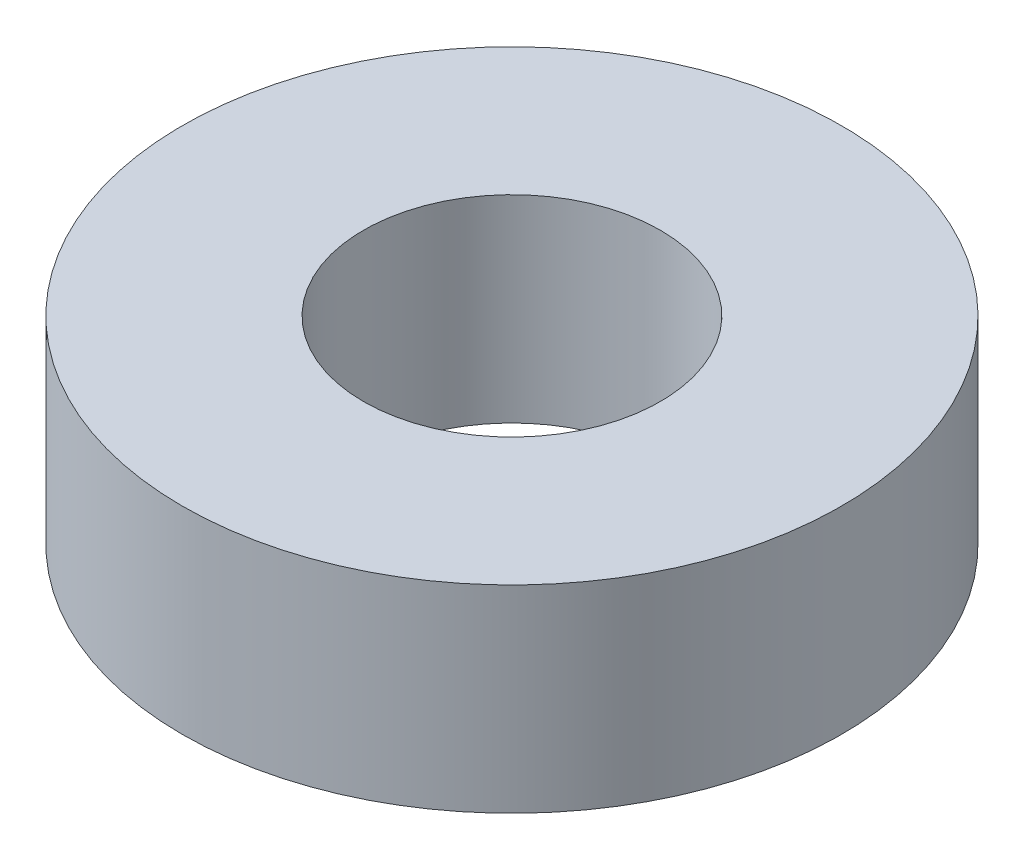
ISO-10303-21;
HEADER;
FILE_DESCRIPTION(('STEP AP214'),'2;1');
FILE_NAME('part.step','',(''),(''),'','','');
FILE_SCHEMA(('AUTOMOTIVE_DESIGN { 1 0 10303 214 1 1 1 1 }'));
ENDSEC;
DATA;
#1=APPLICATION_CONTEXT('core data for automotive mechanical design processes');
#2=APPLICATION_PROTOCOL_DEFINITION('international standard','automotive_design',2000,#1);
#3=PRODUCT_CONTEXT('',#1,'mechanical');
#4=PRODUCT('Part','Part','',(#3));
#5=PRODUCT_RELATED_PRODUCT_CATEGORY('part','',(#4));
#6=PRODUCT_DEFINITION_FORMATION('','',#4);
#7=PRODUCT_DEFINITION_CONTEXT('part definition',#1,'design');
#8=PRODUCT_DEFINITION('design','',#6,#7);
#9=PRODUCT_DEFINITION_SHAPE('','',#8);
#10=(LENGTH_UNIT() NAMED_UNIT(*) SI_UNIT(.MILLI.,.METRE.));
#11=(NAMED_UNIT(*) PLANE_ANGLE_UNIT() SI_UNIT($,.RADIAN.));
#12=(NAMED_UNIT(*) SI_UNIT($,.STERADIAN.) SOLID_ANGLE_UNIT());
#13=UNCERTAINTY_MEASURE_WITH_UNIT(LENGTH_MEASURE(1.E-05),#10,'distance_accuracy_value','');
#14=(GEOMETRIC_REPRESENTATION_CONTEXT(3) GLOBAL_UNCERTAINTY_ASSIGNED_CONTEXT((#13)) GLOBAL_UNIT_ASSIGNED_CONTEXT((#10,
#11,#12)) REPRESENTATION_CONTEXT('',''));
#15=CARTESIAN_POINT('',(0.,0.,0.));
#16=DIRECTION('',(0.,0.,1.));
#17=DIRECTION('',(1.,0.,0.));
#18=AXIS2_PLACEMENT_3D('',#15,#16,#17);
#19=CARTESIAN_POINT('',(0.,4.5,0.));
#20=DIRECTION('',(0.,-1.,0.));
#21=DIRECTION('',(0.,0.,-1.));
#22=AXIS2_PLACEMENT_3D('',#19,#20,#21);
#23=CYLINDRICAL_SURFACE('',#22,7.5);
#24=CARTESIAN_POINT('',(0.,4.5,0.));
#25=DIRECTION('',(0.,1.,0.));
#26=DIRECTION('',(0.,0.,1.));
#27=AXIS2_PLACEMENT_3D('',#24,#25,#26);
#28=CIRCLE('',#27,7.5);
#29=CARTESIAN_POINT('',(0.,4.5,7.5));
#30=VERTEX_POINT('',#29);
#31=EDGE_CURVE('E10',#30,#30,#28,.T.);
#32=ORIENTED_EDGE('',*,*,#31,.F.);
#33=EDGE_LOOP('',(#32));
#34=FACE_BOUND('',#33,.T.);
#35=CARTESIAN_POINT('',(0.,0.,0.));
#36=DIRECTION('',(0.,1.,0.));
#37=DIRECTION('',(0.,0.,1.));
#38=AXIS2_PLACEMENT_3D('',#35,#36,#37);
#39=CIRCLE('',#38,7.5);
#40=CARTESIAN_POINT('',(0.,0.,7.5));
#41=VERTEX_POINT('',#40);
#42=EDGE_CURVE('E40',#41,#41,#39,.T.);
#43=ORIENTED_EDGE('',*,*,#42,.T.);
#44=EDGE_LOOP('',(#43));
#45=FACE_BOUND('',#44,.T.);
#46=ADVANCED_FACE('F37',(#34,#45),#23,.T.);
#47=CARTESIAN_POINT('',(0.,4.5,0.));
#48=DIRECTION('',(0.,1.,0.));
#49=DIRECTION('',(0.,0.,1.));
#50=AXIS2_PLACEMENT_3D('',#47,#48,#49);
#51=PLANE('',#50);
#52=CARTESIAN_POINT('',(0.,4.5,0.));
#53=DIRECTION('',(0.,1.,0.));
#54=DIRECTION('',(0.,0.,1.));
#55=AXIS2_PLACEMENT_3D('',#52,#53,#54);
#56=CIRCLE('',#55,3.3782);
#57=CARTESIAN_POINT('',(0.,4.5,3.3782));
#58=VERTEX_POINT('',#57);
#59=EDGE_CURVE('E54',#58,#58,#56,.T.);
#60=ORIENTED_EDGE('',*,*,#59,.F.);
#61=EDGE_LOOP('',(#60));
#62=FACE_BOUND('',#61,.T.);
#63=ORIENTED_EDGE('',*,*,#31,.T.);
#64=EDGE_LOOP('',(#63));
#65=FACE_BOUND('',#64,.T.);
#66=ADVANCED_FACE('F61',(#62,#65),#51,.T.);
#67=CARTESIAN_POINT('',(0.,0.,0.));
#68=DIRECTION('',(0.,1.,0.));
#69=DIRECTION('',(0.,0.,1.));
#70=AXIS2_PLACEMENT_3D('',#67,#68,#69);
#71=PLANE('',#70);
#72=CARTESIAN_POINT('',(0.,0.,0.));
#73=DIRECTION('',(0.,1.,0.));
#74=DIRECTION('',(0.,0.,1.));
#75=AXIS2_PLACEMENT_3D('',#72,#73,#74);
#76=CIRCLE('',#75,3.3782);
#77=CARTESIAN_POINT('',(0.,0.,3.3782));
#78=VERTEX_POINT('',#77);
#79=EDGE_CURVE('E49',#78,#78,#76,.T.);
#80=ORIENTED_EDGE('',*,*,#79,.T.);
#81=EDGE_LOOP('',(#80));
#82=FACE_BOUND('',#81,.T.);
#83=ORIENTED_EDGE('',*,*,#42,.F.);
#84=EDGE_LOOP('',(#83));
#85=FACE_BOUND('',#84,.T.);
#86=ADVANCED_FACE('F63',(#82,#85),#71,.F.);
#87=CARTESIAN_POINT('',(0.,4.5,0.));
#88=DIRECTION('',(0.,1.,0.));
#89=DIRECTION('',(0.,0.,1.));
#90=AXIS2_PLACEMENT_3D('',#87,#88,#89);
#91=CYLINDRICAL_SURFACE('',#90,3.3782);
#92=ORIENTED_EDGE('',*,*,#79,.F.);
#93=EDGE_LOOP('',(#92));
#94=FACE_BOUND('',#93,.T.);
#95=ORIENTED_EDGE('',*,*,#59,.T.);
#96=EDGE_LOOP('',(#95));
#97=FACE_BOUND('',#96,.T.);
#98=ADVANCED_FACE('F59',(#94,#97),#91,.F.);
#99=CLOSED_SHELL('',(#46,#66,#86,#98));
#100=MANIFOLD_SOLID_BREP('B2',#99);
#101=ADVANCED_BREP_SHAPE_REPRESENTATION('',(#18,#100),#14);
#102=SHAPE_DEFINITION_REPRESENTATION(#9,#101);
ENDSEC;
END-ISO-10303-21;
